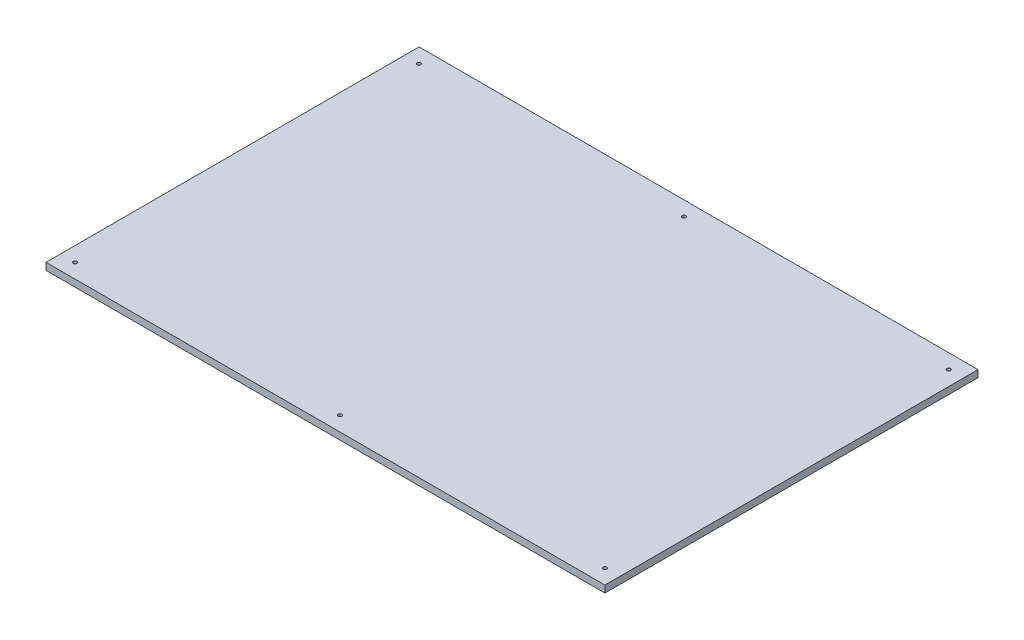
ISO-10303-21;
HEADER;
FILE_DESCRIPTION(('STEP AP214'),'2;1');
FILE_NAME('part.step','',(''),(''),'','','');
FILE_SCHEMA(('AUTOMOTIVE_DESIGN { 1 0 10303 214 1 1 1 1 }'));
ENDSEC;
DATA;
#1=APPLICATION_CONTEXT('core data for automotive mechanical design processes');
#2=APPLICATION_PROTOCOL_DEFINITION('international standard','automotive_design',2000,#1);
#3=PRODUCT_CONTEXT('',#1,'mechanical');
#4=PRODUCT('Part','Part','',(#3));
#5=PRODUCT_RELATED_PRODUCT_CATEGORY('part','',(#4));
#6=PRODUCT_DEFINITION_FORMATION('','',#4);
#7=PRODUCT_DEFINITION_CONTEXT('part definition',#1,'design');
#8=PRODUCT_DEFINITION('design','',#6,#7);
#9=PRODUCT_DEFINITION_SHAPE('','',#8);
#10=(LENGTH_UNIT() NAMED_UNIT(*) SI_UNIT(.MILLI.,.METRE.));
#11=(NAMED_UNIT(*) PLANE_ANGLE_UNIT() SI_UNIT($,.RADIAN.));
#12=(NAMED_UNIT(*) SI_UNIT($,.STERADIAN.) SOLID_ANGLE_UNIT());
#13=UNCERTAINTY_MEASURE_WITH_UNIT(LENGTH_MEASURE(1.E-05),#10,'distance_accuracy_value','');
#14=(GEOMETRIC_REPRESENTATION_CONTEXT(3) GLOBAL_UNCERTAINTY_ASSIGNED_CONTEXT((#13)) GLOBAL_UNIT_ASSIGNED_CONTEXT((#10,
#11,#12)) REPRESENTATION_CONTEXT('',''));
#15=CARTESIAN_POINT('',(0.,0.,0.));
#16=DIRECTION('',(0.,0.,1.));
#17=DIRECTION('',(1.,0.,0.));
#18=AXIS2_PLACEMENT_3D('',#15,#16,#17);
#19=CARTESIAN_POINT('',(-1015.,25.4,-802.5));
#20=DIRECTION('',(1.,0.,0.));
#21=DIRECTION('',(0.,0.,-1.));
#22=AXIS2_PLACEMENT_3D('',#19,#20,#21);
#23=PLANE('',#22);
#24=DIRECTION('',(0.,0.,1.));
#25=VECTOR('',#24,1.);
#26=CARTESIAN_POINT('',(-1015.,0.,-802.5));
#27=LINE('',#26,#25);
#28=CARTESIAN_POINT('',(-1015.,0.,-802.5));
#29=VERTEX_POINT('',#28);
#30=CARTESIAN_POINT('',(-1015.,0.,552.5));
#31=VERTEX_POINT('',#30);
#32=EDGE_CURVE('E100',#29,#31,#27,.T.);
#33=ORIENTED_EDGE('',*,*,#32,.T.);
#34=DIRECTION('',(0.,-1.,0.));
#35=VECTOR('',#34,1.);
#36=CARTESIAN_POINT('',(-1015.,25.4,552.5));
#37=LINE('',#36,#35);
#38=CARTESIAN_POINT('',(-1015.,25.4,552.5));
#39=VERTEX_POINT('',#38);
#40=EDGE_CURVE('E11',#39,#31,#37,.T.);
#41=ORIENTED_EDGE('',*,*,#40,.F.);
#42=DIRECTION('',(0.,0.,1.));
#43=VECTOR('',#42,1.);
#44=CARTESIAN_POINT('',(-1015.,25.4,-802.5));
#45=LINE('',#44,#43);
#46=CARTESIAN_POINT('',(-1015.,25.4,-802.5));
#47=VERTEX_POINT('',#46);
#48=EDGE_CURVE('E88',#47,#39,#45,.T.);
#49=ORIENTED_EDGE('',*,*,#48,.F.);
#50=DIRECTION('',(0.,-1.,0.));
#51=VECTOR('',#50,1.);
#52=CARTESIAN_POINT('',(-1015.,25.4,-802.5));
#53=LINE('',#52,#51);
#54=EDGE_CURVE('E96',#47,#29,#53,.T.);
#55=ORIENTED_EDGE('',*,*,#54,.T.);
#56=EDGE_LOOP('',(#33,#41,#49,#55));
#57=FACE_BOUND('',#56,.T.);
#58=ADVANCED_FACE('F37',(#57),#23,.F.);
#59=CARTESIAN_POINT('',(-1015.,25.4,552.5));
#60=DIRECTION('',(0.,0.,-1.));
#61=DIRECTION('',(-1.,0.,0.));
#62=AXIS2_PLACEMENT_3D('',#59,#60,#61);
#63=PLANE('',#62);
#64=DIRECTION('',(1.,0.,0.));
#65=VECTOR('',#64,1.);
#66=CARTESIAN_POINT('',(-1015.,0.,552.5));
#67=LINE('',#66,#65);
#68=CARTESIAN_POINT('',(1015.,0.,552.5));
#69=VERTEX_POINT('',#68);
#70=EDGE_CURVE('E92',#31,#69,#67,.T.);
#71=ORIENTED_EDGE('',*,*,#70,.T.);
#72=DIRECTION('',(0.,-1.,0.));
#73=VECTOR('',#72,1.);
#74=CARTESIAN_POINT('',(1015.,25.4,552.5));
#75=LINE('',#74,#73);
#76=CARTESIAN_POINT('',(1015.,25.4,552.5));
#77=VERTEX_POINT('',#76);
#78=EDGE_CURVE('E45',#77,#69,#75,.T.);
#79=ORIENTED_EDGE('',*,*,#78,.F.);
#80=DIRECTION('',(1.,0.,0.));
#81=VECTOR('',#80,1.);
#82=CARTESIAN_POINT('',(-1015.,25.4,552.5));
#83=LINE('',#82,#81);
#84=EDGE_CURVE('E83',#39,#77,#83,.T.);
#85=ORIENTED_EDGE('',*,*,#84,.F.);
#86=ORIENTED_EDGE('',*,*,#40,.T.);
#87=EDGE_LOOP('',(#71,#79,#85,#86));
#88=FACE_BOUND('',#87,.T.);
#89=ADVANCED_FACE('F91',(#88),#63,.F.);
#90=CARTESIAN_POINT('',(1015.,25.4,-802.5));
#91=DIRECTION('',(-1.,0.,0.));
#92=DIRECTION('',(0.,0.,1.));
#93=AXIS2_PLACEMENT_3D('',#90,#91,#92);
#94=PLANE('',#93);
#95=DIRECTION('',(0.,0.,-1.));
#96=VECTOR('',#95,1.);
#97=CARTESIAN_POINT('',(1015.,0.,-802.5));
#98=LINE('',#97,#96);
#99=CARTESIAN_POINT('',(1015.,0.,-802.5));
#100=VERTEX_POINT('',#99);
#101=EDGE_CURVE('E70',#69,#100,#98,.T.);
#102=ORIENTED_EDGE('',*,*,#101,.T.);
#103=DIRECTION('',(0.,-1.,0.));
#104=VECTOR('',#103,1.);
#105=CARTESIAN_POINT('',(1015.,25.4,-802.5));
#106=LINE('',#105,#104);
#107=CARTESIAN_POINT('',(1015.,25.4,-802.5));
#108=VERTEX_POINT('',#107);
#109=EDGE_CURVE('E93',#108,#100,#106,.T.);
#110=ORIENTED_EDGE('',*,*,#109,.F.);
#111=DIRECTION('',(0.,0.,-1.));
#112=VECTOR('',#111,1.);
#113=CARTESIAN_POINT('',(1015.,25.4,-802.5));
#114=LINE('',#113,#112);
#115=EDGE_CURVE('E86',#77,#108,#114,.T.);
#116=ORIENTED_EDGE('',*,*,#115,.F.);
#117=ORIENTED_EDGE('',*,*,#78,.T.);
#118=EDGE_LOOP('',(#102,#110,#116,#117));
#119=FACE_BOUND('',#118,.T.);
#120=ADVANCED_FACE('F94',(#119),#94,.F.);
#121=CARTESIAN_POINT('',(-1015.,25.4,-802.5));
#122=DIRECTION('',(0.,0.,1.));
#123=DIRECTION('',(1.,0.,0.));
#124=AXIS2_PLACEMENT_3D('',#121,#122,#123);
#125=PLANE('',#124);
#126=DIRECTION('',(-1.,0.,0.));
#127=VECTOR('',#126,1.);
#128=CARTESIAN_POINT('',(-1015.,0.,-802.5));
#129=LINE('',#128,#127);
#130=EDGE_CURVE('E76',#100,#29,#129,.T.);
#131=ORIENTED_EDGE('',*,*,#130,.T.);
#132=ORIENTED_EDGE('',*,*,#54,.F.);
#133=DIRECTION('',(-1.,0.,0.));
#134=VECTOR('',#133,1.);
#135=CARTESIAN_POINT('',(-1015.,25.4,-802.5));
#136=LINE('',#135,#134);
#137=EDGE_CURVE('E53',#108,#47,#136,.T.);
#138=ORIENTED_EDGE('',*,*,#137,.F.);
#139=ORIENTED_EDGE('',*,*,#109,.T.);
#140=EDGE_LOOP('',(#131,#132,#138,#139));
#141=FACE_BOUND('',#140,.T.);
#142=ADVANCED_FACE('F108',(#141),#125,.F.);
#143=CARTESIAN_POINT('',(0.,25.4,0.));
#144=DIRECTION('',(0.,1.,0.));
#145=DIRECTION('',(0.,0.,1.));
#146=AXIS2_PLACEMENT_3D('',#143,#144,#145);
#147=PLANE('',#146);
#148=CARTESIAN_POINT('',(962.,25.4,499.5));
#149=DIRECTION('',(0.,-1.,0.));
#150=DIRECTION('',(0.,0.,-1.));
#151=AXIS2_PLACEMENT_3D('',#148,#149,#150);
#152=CIRCLE('',#151,6.75000000000003);
#153=CARTESIAN_POINT('',(962.,25.4,492.75));
#154=VERTEX_POINT('',#153);
#155=EDGE_CURVE('E173',#154,#154,#152,.T.);
#156=ORIENTED_EDGE('',*,*,#155,.T.);
#157=EDGE_LOOP('',(#156));
#158=FACE_BOUND('',#157,.T.);
#159=CARTESIAN_POINT('',(962.000000000001,25.4,-749.5));
#160=DIRECTION('',(0.,-1.,0.));
#161=DIRECTION('',(0.,0.,-1.));
#162=AXIS2_PLACEMENT_3D('',#159,#160,#161);
#163=CIRCLE('',#162,6.75000000000003);
#164=CARTESIAN_POINT('',(962.000000000001,25.4,-756.250000000001));
#165=VERTEX_POINT('',#164);
#166=EDGE_CURVE('E161',#165,#165,#163,.T.);
#167=ORIENTED_EDGE('',*,*,#166,.T.);
#168=EDGE_LOOP('',(#167));
#169=FACE_BOUND('',#168,.T.);
#170=CARTESIAN_POINT('',(0.,25.4,-749.5));
#171=DIRECTION('',(0.,-1.,0.));
#172=DIRECTION('',(0.,0.,-1.));
#173=AXIS2_PLACEMENT_3D('',#170,#171,#172);
#174=CIRCLE('',#173,6.75);
#175=CARTESIAN_POINT('',(0.,25.4,-756.25));
#176=VERTEX_POINT('',#175);
#177=EDGE_CURVE('E149',#176,#176,#174,.T.);
#178=ORIENTED_EDGE('',*,*,#177,.T.);
#179=EDGE_LOOP('',(#178));
#180=FACE_BOUND('',#179,.T.);
#181=CARTESIAN_POINT('',(-962.,25.4,-749.5));
#182=DIRECTION('',(0.,-1.,0.));
#183=DIRECTION('',(0.,0.,-1.));
#184=AXIS2_PLACEMENT_3D('',#181,#182,#183);
#185=CIRCLE('',#184,6.75000000000003);
#186=CARTESIAN_POINT('',(-962.,25.4,-756.25));
#187=VERTEX_POINT('',#186);
#188=EDGE_CURVE('E137',#187,#187,#185,.T.);
#189=ORIENTED_EDGE('',*,*,#188,.T.);
#190=EDGE_LOOP('',(#189));
#191=FACE_BOUND('',#190,.T.);
#192=CARTESIAN_POINT('',(-962.,25.4,499.5));
#193=DIRECTION('',(0.,-1.,0.));
#194=DIRECTION('',(0.,0.,-1.));
#195=AXIS2_PLACEMENT_3D('',#192,#193,#194);
#196=CIRCLE('',#195,6.75000000000003);
#197=CARTESIAN_POINT('',(-962.,25.4,492.75));
#198=VERTEX_POINT('',#197);
#199=EDGE_CURVE('E125',#198,#198,#196,.T.);
#200=ORIENTED_EDGE('',*,*,#199,.T.);
#201=EDGE_LOOP('',(#200));
#202=FACE_BOUND('',#201,.T.);
#203=CARTESIAN_POINT('',(-2.30709548687535E-13,25.4,499.5));
#204=DIRECTION('',(0.,-1.,0.));
#205=DIRECTION('',(0.,0.,-1.));
#206=AXIS2_PLACEMENT_3D('',#203,#204,#205);
#207=CIRCLE('',#206,6.75);
#208=CARTESIAN_POINT('',(-2.30709548687535E-13,25.4,492.75));
#209=VERTEX_POINT('',#208);
#210=EDGE_CURVE('E103',#209,#209,#207,.T.);
#211=ORIENTED_EDGE('',*,*,#210,.T.);
#212=EDGE_LOOP('',(#211));
#213=FACE_BOUND('',#212,.T.);
#214=ORIENTED_EDGE('',*,*,#48,.T.);
#215=ORIENTED_EDGE('',*,*,#84,.T.);
#216=ORIENTED_EDGE('',*,*,#115,.T.);
#217=ORIENTED_EDGE('',*,*,#137,.T.);
#218=EDGE_LOOP('',(#214,#215,#216,#217));
#219=FACE_BOUND('',#218,.T.);
#220=ADVANCED_FACE('F84',(#158,#169,#180,#191,#202,#213,#219),#147,.T.);
#221=CARTESIAN_POINT('',(0.,0.,0.));
#222=DIRECTION('',(0.,1.,0.));
#223=DIRECTION('',(0.,0.,1.));
#224=AXIS2_PLACEMENT_3D('',#221,#222,#223);
#225=PLANE('',#224);
#226=CARTESIAN_POINT('',(962.,0.,499.5));
#227=DIRECTION('',(0.,-1.,0.));
#228=DIRECTION('',(0.,0.,-1.));
#229=AXIS2_PLACEMENT_3D('',#226,#227,#228);
#230=CIRCLE('',#229,10.);
#231=CARTESIAN_POINT('',(962.,0.,489.5));
#232=VERTEX_POINT('',#231);
#233=EDGE_CURVE('E182',#232,#232,#230,.T.);
#234=ORIENTED_EDGE('',*,*,#233,.F.);
#235=EDGE_LOOP('',(#234));
#236=FACE_BOUND('',#235,.T.);
#237=CARTESIAN_POINT('',(962.000000000001,0.,-749.5));
#238=DIRECTION('',(0.,-1.,0.));
#239=DIRECTION('',(0.,0.,-1.));
#240=AXIS2_PLACEMENT_3D('',#237,#238,#239);
#241=CIRCLE('',#240,10.);
#242=CARTESIAN_POINT('',(962.000000000001,0.,-759.5));
#243=VERTEX_POINT('',#242);
#244=EDGE_CURVE('E170',#243,#243,#241,.T.);
#245=ORIENTED_EDGE('',*,*,#244,.F.);
#246=EDGE_LOOP('',(#245));
#247=FACE_BOUND('',#246,.T.);
#248=CARTESIAN_POINT('',(0.,0.,-749.5));
#249=DIRECTION('',(0.,-1.,0.));
#250=DIRECTION('',(0.,0.,-1.));
#251=AXIS2_PLACEMENT_3D('',#248,#249,#250);
#252=CIRCLE('',#251,10.);
#253=CARTESIAN_POINT('',(0.,0.,-759.5));
#254=VERTEX_POINT('',#253);
#255=EDGE_CURVE('E158',#254,#254,#252,.T.);
#256=ORIENTED_EDGE('',*,*,#255,.F.);
#257=EDGE_LOOP('',(#256));
#258=FACE_BOUND('',#257,.T.);
#259=CARTESIAN_POINT('',(-962.,0.,-749.5));
#260=DIRECTION('',(0.,-1.,0.));
#261=DIRECTION('',(0.,0.,-1.));
#262=AXIS2_PLACEMENT_3D('',#259,#260,#261);
#263=CIRCLE('',#262,10.);
#264=CARTESIAN_POINT('',(-962.,0.,-759.5));
#265=VERTEX_POINT('',#264);
#266=EDGE_CURVE('E146',#265,#265,#263,.T.);
#267=ORIENTED_EDGE('',*,*,#266,.F.);
#268=EDGE_LOOP('',(#267));
#269=FACE_BOUND('',#268,.T.);
#270=CARTESIAN_POINT('',(-962.,0.,499.5));
#271=DIRECTION('',(0.,-1.,0.));
#272=DIRECTION('',(0.,0.,-1.));
#273=AXIS2_PLACEMENT_3D('',#270,#271,#272);
#274=CIRCLE('',#273,10.);
#275=CARTESIAN_POINT('',(-962.,0.,489.5));
#276=VERTEX_POINT('',#275);
#277=EDGE_CURVE('E134',#276,#276,#274,.T.);
#278=ORIENTED_EDGE('',*,*,#277,.F.);
#279=EDGE_LOOP('',(#278));
#280=FACE_BOUND('',#279,.T.);
#281=CARTESIAN_POINT('',(-2.30709548687535E-13,0.,499.5));
#282=DIRECTION('',(0.,-1.,0.));
#283=DIRECTION('',(0.,0.,-1.));
#284=AXIS2_PLACEMENT_3D('',#281,#282,#283);
#285=CIRCLE('',#284,10.);
#286=CARTESIAN_POINT('',(-2.30709548687535E-13,0.,489.5));
#287=VERTEX_POINT('',#286);
#288=EDGE_CURVE('E122',#287,#287,#285,.T.);
#289=ORIENTED_EDGE('',*,*,#288,.F.);
#290=EDGE_LOOP('',(#289));
#291=FACE_BOUND('',#290,.T.);
#292=ORIENTED_EDGE('',*,*,#32,.F.);
#293=ORIENTED_EDGE('',*,*,#130,.F.);
#294=ORIENTED_EDGE('',*,*,#101,.F.);
#295=ORIENTED_EDGE('',*,*,#70,.F.);
#296=EDGE_LOOP('',(#292,#293,#294,#295));
#297=FACE_BOUND('',#296,.T.);
#298=ADVANCED_FACE('F111',(#236,#247,#258,#269,#280,#291,#297),#225,.F.);
#299=CARTESIAN_POINT('',(-2.30709548687535E-13,0.,499.5));
#300=DIRECTION('',(0.,-1.,0.));
#301=DIRECTION('',(0.,0.,-1.));
#302=AXIS2_PLACEMENT_3D('',#299,#300,#301);
#303=CYLINDRICAL_SURFACE('',#302,6.75000000000001);
#304=ORIENTED_EDGE('',*,*,#210,.F.);
#305=EDGE_LOOP('',(#304));
#306=FACE_BOUND('',#305,.T.);
#307=CARTESIAN_POINT('',(-2.30709548687535E-13,12.,499.5));
#308=DIRECTION('',(0.,-1.,0.));
#309=DIRECTION('',(0.,0.,-1.));
#310=AXIS2_PLACEMENT_3D('',#307,#308,#309);
#311=CIRCLE('',#310,6.75000000000001);
#312=CARTESIAN_POINT('',(-2.30709548687535E-13,12.,492.75));
#313=VERTEX_POINT('',#312);
#314=EDGE_CURVE('E116',#313,#313,#311,.T.);
#315=ORIENTED_EDGE('',*,*,#314,.T.);
#316=EDGE_LOOP('',(#315));
#317=FACE_BOUND('',#316,.T.);
#318=ADVANCED_FACE('F190',(#306,#317),#303,.F.);
#319=CARTESIAN_POINT('',(6.74999999999978,12.,499.5));
#320=DIRECTION('',(0.,1.,0.));
#321=DIRECTION('',(0.,0.,1.));
#322=AXIS2_PLACEMENT_3D('',#319,#320,#321);
#323=PLANE('',#322);
#324=ORIENTED_EDGE('',*,*,#314,.F.);
#325=EDGE_LOOP('',(#324));
#326=FACE_BOUND('',#325,.T.);
#327=CARTESIAN_POINT('',(-2.30709548687535E-13,12.,499.5));
#328=DIRECTION('',(0.,-1.,0.));
#329=DIRECTION('',(0.,0.,-1.));
#330=AXIS2_PLACEMENT_3D('',#327,#328,#329);
#331=CIRCLE('',#330,9.99999999999999);
#332=CARTESIAN_POINT('',(-2.30709548687535E-13,12.,489.5));
#333=VERTEX_POINT('',#332);
#334=EDGE_CURVE('E119',#333,#333,#331,.T.);
#335=ORIENTED_EDGE('',*,*,#334,.T.);
#336=EDGE_LOOP('',(#335));
#337=FACE_BOUND('',#336,.T.);
#338=ADVANCED_FACE('F205',(#326,#337),#323,.F.);
#339=CARTESIAN_POINT('',(-2.30709548687535E-13,0.,499.5));
#340=DIRECTION('',(0.,-1.,0.));
#341=DIRECTION('',(0.,0.,-1.));
#342=AXIS2_PLACEMENT_3D('',#339,#340,#341);
#343=CYLINDRICAL_SURFACE('',#342,9.99999999999999);
#344=ORIENTED_EDGE('',*,*,#334,.F.);
#345=EDGE_LOOP('',(#344));
#346=FACE_BOUND('',#345,.T.);
#347=ORIENTED_EDGE('',*,*,#288,.T.);
#348=EDGE_LOOP('',(#347));
#349=FACE_BOUND('',#348,.T.);
#350=ADVANCED_FACE('F202',(#346,#349),#343,.F.);
#351=CARTESIAN_POINT('',(-962.,0.,499.5));
#352=DIRECTION('',(0.,-1.,0.));
#353=DIRECTION('',(0.,0.,-1.));
#354=AXIS2_PLACEMENT_3D('',#351,#352,#353);
#355=CYLINDRICAL_SURFACE('',#354,6.75000000000003);
#356=ORIENTED_EDGE('',*,*,#199,.F.);
#357=EDGE_LOOP('',(#356));
#358=FACE_BOUND('',#357,.T.);
#359=CARTESIAN_POINT('',(-962.,12.,499.5));
#360=DIRECTION('',(0.,-1.,0.));
#361=DIRECTION('',(0.,0.,-1.));
#362=AXIS2_PLACEMENT_3D('',#359,#360,#361);
#363=CIRCLE('',#362,6.75000000000003);
#364=CARTESIAN_POINT('',(-962.,12.,492.75));
#365=VERTEX_POINT('',#364);
#366=EDGE_CURVE('E128',#365,#365,#363,.T.);
#367=ORIENTED_EDGE('',*,*,#366,.T.);
#368=EDGE_LOOP('',(#367));
#369=FACE_BOUND('',#368,.T.);
#370=ADVANCED_FACE('F204',(#358,#369),#355,.F.);
#371=CARTESIAN_POINT('',(-955.25,12.,499.5));
#372=DIRECTION('',(0.,1.,0.));
#373=DIRECTION('',(0.,0.,1.));
#374=AXIS2_PLACEMENT_3D('',#371,#372,#373);
#375=PLANE('',#374);
#376=ORIENTED_EDGE('',*,*,#366,.F.);
#377=EDGE_LOOP('',(#376));
#378=FACE_BOUND('',#377,.T.);
#379=CARTESIAN_POINT('',(-962.,12.,499.5));
#380=DIRECTION('',(0.,-1.,0.));
#381=DIRECTION('',(0.,0.,-1.));
#382=AXIS2_PLACEMENT_3D('',#379,#380,#381);
#383=CIRCLE('',#382,10.);
#384=CARTESIAN_POINT('',(-962.,12.,489.5));
#385=VERTEX_POINT('',#384);
#386=EDGE_CURVE('E131',#385,#385,#383,.T.);
#387=ORIENTED_EDGE('',*,*,#386,.T.);
#388=EDGE_LOOP('',(#387));
#389=FACE_BOUND('',#388,.T.);
#390=ADVANCED_FACE('F212',(#378,#389),#375,.F.);
#391=CARTESIAN_POINT('',(-962.,0.,499.5));
#392=DIRECTION('',(0.,-1.,0.));
#393=DIRECTION('',(0.,0.,-1.));
#394=AXIS2_PLACEMENT_3D('',#391,#392,#393);
#395=CYLINDRICAL_SURFACE('',#394,10.);
#396=ORIENTED_EDGE('',*,*,#386,.F.);
#397=EDGE_LOOP('',(#396));
#398=FACE_BOUND('',#397,.T.);
#399=ORIENTED_EDGE('',*,*,#277,.T.);
#400=EDGE_LOOP('',(#399));
#401=FACE_BOUND('',#400,.T.);
#402=ADVANCED_FACE('F269',(#398,#401),#395,.F.);
#403=CARTESIAN_POINT('',(-962.,0.,-749.5));
#404=DIRECTION('',(0.,-1.,0.));
#405=DIRECTION('',(0.,0.,-1.));
#406=AXIS2_PLACEMENT_3D('',#403,#404,#405);
#407=CYLINDRICAL_SURFACE('',#406,6.75000000000003);
#408=ORIENTED_EDGE('',*,*,#188,.F.);
#409=EDGE_LOOP('',(#408));
#410=FACE_BOUND('',#409,.T.);
#411=CARTESIAN_POINT('',(-962.,12.,-749.5));
#412=DIRECTION('',(0.,-1.,0.));
#413=DIRECTION('',(0.,0.,-1.));
#414=AXIS2_PLACEMENT_3D('',#411,#412,#413);
#415=CIRCLE('',#414,6.75000000000003);
#416=CARTESIAN_POINT('',(-962.,12.,-756.25));
#417=VERTEX_POINT('',#416);
#418=EDGE_CURVE('E140',#417,#417,#415,.T.);
#419=ORIENTED_EDGE('',*,*,#418,.T.);
#420=EDGE_LOOP('',(#419));
#421=FACE_BOUND('',#420,.T.);
#422=ADVANCED_FACE('F279',(#410,#421),#407,.F.);
#423=CARTESIAN_POINT('',(-955.25,12.,-749.5));
#424=DIRECTION('',(0.,1.,0.));
#425=DIRECTION('',(0.,0.,1.));
#426=AXIS2_PLACEMENT_3D('',#423,#424,#425);
#427=PLANE('',#426);
#428=ORIENTED_EDGE('',*,*,#418,.F.);
#429=EDGE_LOOP('',(#428));
#430=FACE_BOUND('',#429,.T.);
#431=CARTESIAN_POINT('',(-962.,12.,-749.5));
#432=DIRECTION('',(0.,-1.,0.));
#433=DIRECTION('',(0.,0.,-1.));
#434=AXIS2_PLACEMENT_3D('',#431,#432,#433);
#435=CIRCLE('',#434,10.);
#436=CARTESIAN_POINT('',(-962.,12.,-759.5));
#437=VERTEX_POINT('',#436);
#438=EDGE_CURVE('E143',#437,#437,#435,.T.);
#439=ORIENTED_EDGE('',*,*,#438,.T.);
#440=EDGE_LOOP('',(#439));
#441=FACE_BOUND('',#440,.T.);
#442=ADVANCED_FACE('F289',(#430,#441),#427,.F.);
#443=CARTESIAN_POINT('',(-962.,0.,-749.5));
#444=DIRECTION('',(0.,-1.,0.));
#445=DIRECTION('',(0.,0.,-1.));
#446=AXIS2_PLACEMENT_3D('',#443,#444,#445);
#447=CYLINDRICAL_SURFACE('',#446,10.);
#448=ORIENTED_EDGE('',*,*,#438,.F.);
#449=EDGE_LOOP('',(#448));
#450=FACE_BOUND('',#449,.T.);
#451=ORIENTED_EDGE('',*,*,#266,.T.);
#452=EDGE_LOOP('',(#451));
#453=FACE_BOUND('',#452,.T.);
#454=ADVANCED_FACE('F299',(#450,#453),#447,.F.);
#455=CARTESIAN_POINT('',(0.,0.,-749.5));
#456=DIRECTION('',(0.,-1.,0.));
#457=DIRECTION('',(0.,0.,-1.));
#458=AXIS2_PLACEMENT_3D('',#455,#456,#457);
#459=CYLINDRICAL_SURFACE('',#458,6.75000000000001);
#460=ORIENTED_EDGE('',*,*,#177,.F.);
#461=EDGE_LOOP('',(#460));
#462=FACE_BOUND('',#461,.T.);
#463=CARTESIAN_POINT('',(0.,12.,-749.5));
#464=DIRECTION('',(0.,-1.,0.));
#465=DIRECTION('',(0.,0.,-1.));
#466=AXIS2_PLACEMENT_3D('',#463,#464,#465);
#467=CIRCLE('',#466,6.75000000000001);
#468=CARTESIAN_POINT('',(0.,12.,-756.25));
#469=VERTEX_POINT('',#468);
#470=EDGE_CURVE('E152',#469,#469,#467,.T.);
#471=ORIENTED_EDGE('',*,*,#470,.T.);
#472=EDGE_LOOP('',(#471));
#473=FACE_BOUND('',#472,.T.);
#474=ADVANCED_FACE('F309',(#462,#473),#459,.F.);
#475=CARTESIAN_POINT('',(6.75000000000002,12.,-749.5));
#476=DIRECTION('',(0.,1.,0.));
#477=DIRECTION('',(0.,0.,1.));
#478=AXIS2_PLACEMENT_3D('',#475,#476,#477);
#479=PLANE('',#478);
#480=ORIENTED_EDGE('',*,*,#470,.F.);
#481=EDGE_LOOP('',(#480));
#482=FACE_BOUND('',#481,.T.);
#483=CARTESIAN_POINT('',(0.,12.,-749.5));
#484=DIRECTION('',(0.,-1.,0.));
#485=DIRECTION('',(0.,0.,-1.));
#486=AXIS2_PLACEMENT_3D('',#483,#484,#485);
#487=CIRCLE('',#486,9.99999999999999);
#488=CARTESIAN_POINT('',(0.,12.,-759.5));
#489=VERTEX_POINT('',#488);
#490=EDGE_CURVE('E155',#489,#489,#487,.T.);
#491=ORIENTED_EDGE('',*,*,#490,.T.);
#492=EDGE_LOOP('',(#491));
#493=FACE_BOUND('',#492,.T.);
#494=ADVANCED_FACE('F319',(#482,#493),#479,.F.);
#495=CARTESIAN_POINT('',(0.,0.,-749.5));
#496=DIRECTION('',(0.,-1.,0.));
#497=DIRECTION('',(0.,0.,-1.));
#498=AXIS2_PLACEMENT_3D('',#495,#496,#497);
#499=CYLINDRICAL_SURFACE('',#498,9.99999999999999);
#500=ORIENTED_EDGE('',*,*,#490,.F.);
#501=EDGE_LOOP('',(#500));
#502=FACE_BOUND('',#501,.T.);
#503=ORIENTED_EDGE('',*,*,#255,.T.);
#504=EDGE_LOOP('',(#503));
#505=FACE_BOUND('',#504,.T.);
#506=ADVANCED_FACE('F329',(#502,#505),#499,.F.);
#507=CARTESIAN_POINT('',(962.000000000001,0.,-749.5));
#508=DIRECTION('',(0.,-1.,0.));
#509=DIRECTION('',(0.,0.,-1.));
#510=AXIS2_PLACEMENT_3D('',#507,#508,#509);
#511=CYLINDRICAL_SURFACE('',#510,6.75000000000003);
#512=ORIENTED_EDGE('',*,*,#166,.F.);
#513=EDGE_LOOP('',(#512));
#514=FACE_BOUND('',#513,.T.);
#515=CARTESIAN_POINT('',(962.000000000001,12.,-749.5));
#516=DIRECTION('',(0.,-1.,0.));
#517=DIRECTION('',(0.,0.,-1.));
#518=AXIS2_PLACEMENT_3D('',#515,#516,#517);
#519=CIRCLE('',#518,6.75000000000003);
#520=CARTESIAN_POINT('',(962.000000000001,12.,-756.250000000001));
#521=VERTEX_POINT('',#520);
#522=EDGE_CURVE('E164',#521,#521,#519,.T.);
#523=ORIENTED_EDGE('',*,*,#522,.T.);
#524=EDGE_LOOP('',(#523));
#525=FACE_BOUND('',#524,.T.);
#526=ADVANCED_FACE('F339',(#514,#525),#511,.F.);
#527=CARTESIAN_POINT('',(968.750000000001,12.,-749.5));
#528=DIRECTION('',(0.,1.,0.));
#529=DIRECTION('',(0.,0.,1.));
#530=AXIS2_PLACEMENT_3D('',#527,#528,#529);
#531=PLANE('',#530);
#532=ORIENTED_EDGE('',*,*,#522,.F.);
#533=EDGE_LOOP('',(#532));
#534=FACE_BOUND('',#533,.T.);
#535=CARTESIAN_POINT('',(962.000000000001,12.,-749.5));
#536=DIRECTION('',(0.,-1.,0.));
#537=DIRECTION('',(0.,0.,-1.));
#538=AXIS2_PLACEMENT_3D('',#535,#536,#537);
#539=CIRCLE('',#538,10.);
#540=CARTESIAN_POINT('',(962.000000000001,12.,-759.5));
#541=VERTEX_POINT('',#540);
#542=EDGE_CURVE('E167',#541,#541,#539,.T.);
#543=ORIENTED_EDGE('',*,*,#542,.T.);
#544=EDGE_LOOP('',(#543));
#545=FACE_BOUND('',#544,.T.);
#546=ADVANCED_FACE('F349',(#534,#545),#531,.F.);
#547=CARTESIAN_POINT('',(962.000000000001,0.,-749.5));
#548=DIRECTION('',(0.,-1.,0.));
#549=DIRECTION('',(0.,0.,-1.));
#550=AXIS2_PLACEMENT_3D('',#547,#548,#549);
#551=CYLINDRICAL_SURFACE('',#550,10.);
#552=ORIENTED_EDGE('',*,*,#542,.F.);
#553=EDGE_LOOP('',(#552));
#554=FACE_BOUND('',#553,.T.);
#555=ORIENTED_EDGE('',*,*,#244,.T.);
#556=EDGE_LOOP('',(#555));
#557=FACE_BOUND('',#556,.T.);
#558=ADVANCED_FACE('F359',(#554,#557),#551,.F.);
#559=CARTESIAN_POINT('',(962.,0.,499.5));
#560=DIRECTION('',(0.,-1.,0.));
#561=DIRECTION('',(0.,0.,-1.));
#562=AXIS2_PLACEMENT_3D('',#559,#560,#561);
#563=CYLINDRICAL_SURFACE('',#562,6.75000000000003);
#564=ORIENTED_EDGE('',*,*,#155,.F.);
#565=EDGE_LOOP('',(#564));
#566=FACE_BOUND('',#565,.T.);
#567=CARTESIAN_POINT('',(962.,12.,499.5));
#568=DIRECTION('',(0.,-1.,0.));
#569=DIRECTION('',(0.,0.,-1.));
#570=AXIS2_PLACEMENT_3D('',#567,#568,#569);
#571=CIRCLE('',#570,6.75000000000003);
#572=CARTESIAN_POINT('',(962.,12.,492.75));
#573=VERTEX_POINT('',#572);
#574=EDGE_CURVE('E176',#573,#573,#571,.T.);
#575=ORIENTED_EDGE('',*,*,#574,.T.);
#576=EDGE_LOOP('',(#575));
#577=FACE_BOUND('',#576,.T.);
#578=ADVANCED_FACE('F369',(#566,#577),#563,.F.);
#579=CARTESIAN_POINT('',(968.75,12.,499.5));
#580=DIRECTION('',(0.,1.,0.));
#581=DIRECTION('',(0.,0.,1.));
#582=AXIS2_PLACEMENT_3D('',#579,#580,#581);
#583=PLANE('',#582);
#584=ORIENTED_EDGE('',*,*,#574,.F.);
#585=EDGE_LOOP('',(#584));
#586=FACE_BOUND('',#585,.T.);
#587=CARTESIAN_POINT('',(962.,12.,499.5));
#588=DIRECTION('',(0.,-1.,0.));
#589=DIRECTION('',(0.,0.,-1.));
#590=AXIS2_PLACEMENT_3D('',#587,#588,#589);
#591=CIRCLE('',#590,10.);
#592=CARTESIAN_POINT('',(962.,12.,489.5));
#593=VERTEX_POINT('',#592);
#594=EDGE_CURVE('E179',#593,#593,#591,.T.);
#595=ORIENTED_EDGE('',*,*,#594,.T.);
#596=EDGE_LOOP('',(#595));
#597=FACE_BOUND('',#596,.T.);
#598=ADVANCED_FACE('F379',(#586,#597),#583,.F.);
#599=CARTESIAN_POINT('',(962.,0.,499.5));
#600=DIRECTION('',(0.,-1.,0.));
#601=DIRECTION('',(0.,0.,-1.));
#602=AXIS2_PLACEMENT_3D('',#599,#600,#601);
#603=CYLINDRICAL_SURFACE('',#602,10.);
#604=ORIENTED_EDGE('',*,*,#594,.F.);
#605=EDGE_LOOP('',(#604));
#606=FACE_BOUND('',#605,.T.);
#607=ORIENTED_EDGE('',*,*,#233,.T.);
#608=EDGE_LOOP('',(#607));
#609=FACE_BOUND('',#608,.T.);
#610=ADVANCED_FACE('F186',(#606,#609),#603,.F.);
#611=CLOSED_SHELL('',(#58,#89,#120,#142,#220,#298,#318,#338,#350,#370,#390,#402,#422,#442,#454,
#474,#494,#506,#526,#546,#558,#578,#598,#610));
#612=MANIFOLD_SOLID_BREP('B2',#611);
#613=ADVANCED_BREP_SHAPE_REPRESENTATION('',(#18,#612),#14);
#614=SHAPE_DEFINITION_REPRESENTATION(#9,#613);
ENDSEC;
END-ISO-10303-21;
